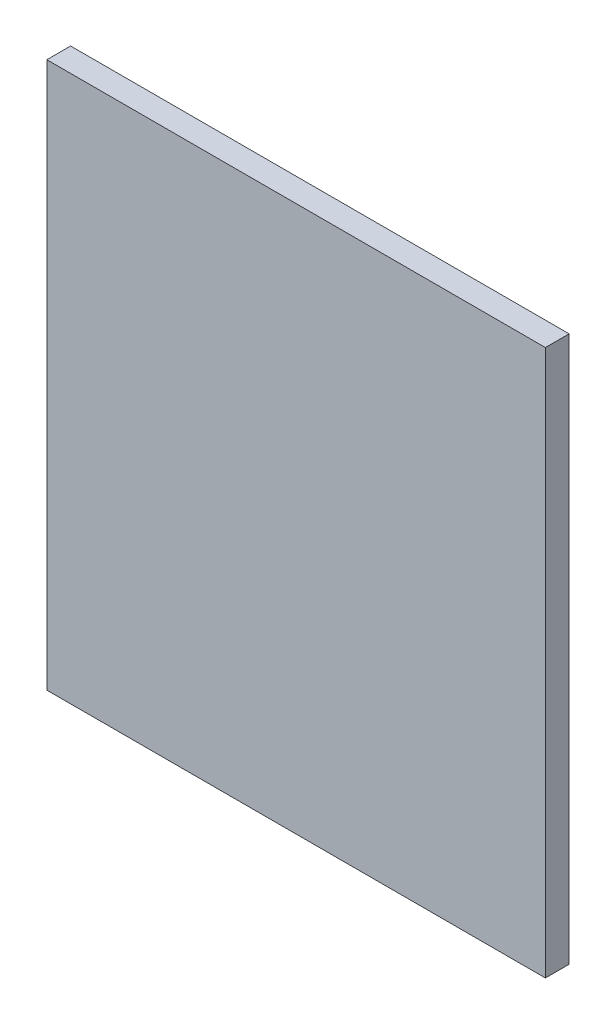
ISO-10303-21;
HEADER;
FILE_DESCRIPTION(('STEP AP214'),'2;1');
FILE_NAME('part.step','',(''),(''),'','','');
FILE_SCHEMA(('AUTOMOTIVE_DESIGN { 1 0 10303 214 1 1 1 1 }'));
ENDSEC;
DATA;
#1=APPLICATION_CONTEXT('core data for automotive mechanical design processes');
#2=APPLICATION_PROTOCOL_DEFINITION('international standard','automotive_design',2000,#1);
#3=PRODUCT_CONTEXT('',#1,'mechanical');
#4=PRODUCT('Part','Part','',(#3));
#5=PRODUCT_RELATED_PRODUCT_CATEGORY('part','',(#4));
#6=PRODUCT_DEFINITION_FORMATION('','',#4);
#7=PRODUCT_DEFINITION_CONTEXT('part definition',#1,'design');
#8=PRODUCT_DEFINITION('design','',#6,#7);
#9=PRODUCT_DEFINITION_SHAPE('','',#8);
#10=(LENGTH_UNIT() NAMED_UNIT(*) SI_UNIT(.MILLI.,.METRE.));
#11=(NAMED_UNIT(*) PLANE_ANGLE_UNIT() SI_UNIT($,.RADIAN.));
#12=(NAMED_UNIT(*) SI_UNIT($,.STERADIAN.) SOLID_ANGLE_UNIT());
#13=UNCERTAINTY_MEASURE_WITH_UNIT(LENGTH_MEASURE(1.E-05),#10,'distance_accuracy_value','');
#14=(GEOMETRIC_REPRESENTATION_CONTEXT(3) GLOBAL_UNCERTAINTY_ASSIGNED_CONTEXT((#13)) GLOBAL_UNIT_ASSIGNED_CONTEXT((#10,
#11,#12)) REPRESENTATION_CONTEXT('',''));
#15=CARTESIAN_POINT('',(0.,0.,0.));
#16=DIRECTION('',(0.,0.,1.));
#17=DIRECTION('',(1.,0.,0.));
#18=AXIS2_PLACEMENT_3D('',#15,#16,#17);
#19=CARTESIAN_POINT('',(133.35,146.05,6.35));
#20=DIRECTION('',(-1.,0.,0.));
#21=DIRECTION('',(0.,-1.,0.));
#22=AXIS2_PLACEMENT_3D('',#19,#20,#21);
#23=PLANE('',#22);
#24=DIRECTION('',(0.,1.,0.));
#25=VECTOR('',#24,1.);
#26=CARTESIAN_POINT('',(133.35,146.05,-6.35));
#27=LINE('',#26,#25);
#28=CARTESIAN_POINT('',(133.35,-146.05,-6.35));
#29=VERTEX_POINT('',#28);
#30=CARTESIAN_POINT('',(133.35,146.05,-6.35));
#31=VERTEX_POINT('',#30);
#32=EDGE_CURVE('E107',#29,#31,#27,.T.);
#33=ORIENTED_EDGE('',*,*,#32,.T.);
#34=DIRECTION('',(0.,0.,-1.));
#35=VECTOR('',#34,1.);
#36=CARTESIAN_POINT('',(133.35,146.05,6.35));
#37=LINE('',#36,#35);
#38=CARTESIAN_POINT('',(133.35,146.05,6.35));
#39=VERTEX_POINT('',#38);
#40=EDGE_CURVE('E11',#39,#31,#37,.T.);
#41=ORIENTED_EDGE('',*,*,#40,.F.);
#42=DIRECTION('',(0.,1.,0.));
#43=VECTOR('',#42,1.);
#44=CARTESIAN_POINT('',(133.35,146.05,6.35));
#45=LINE('',#44,#43);
#46=CARTESIAN_POINT('',(133.35,-146.05,6.35));
#47=VERTEX_POINT('',#46);
#48=EDGE_CURVE('E91',#47,#39,#45,.T.);
#49=ORIENTED_EDGE('',*,*,#48,.F.);
#50=DIRECTION('',(0.,0.,-1.));
#51=VECTOR('',#50,1.);
#52=CARTESIAN_POINT('',(133.35,-146.05,6.35));
#53=LINE('',#52,#51);
#54=EDGE_CURVE('E103',#47,#29,#53,.T.);
#55=ORIENTED_EDGE('',*,*,#54,.T.);
#56=EDGE_LOOP('',(#33,#41,#49,#55));
#57=FACE_BOUND('',#56,.T.);
#58=ADVANCED_FACE('F39',(#57),#23,.F.);
#59=CARTESIAN_POINT('',(-133.35,146.05,6.35));
#60=DIRECTION('',(0.,-1.,0.));
#61=DIRECTION('',(0.,0.,-1.));
#62=AXIS2_PLACEMENT_3D('',#59,#60,#61);
#63=PLANE('',#62);
#64=DIRECTION('',(-1.,0.,0.));
#65=VECTOR('',#64,1.);
#66=CARTESIAN_POINT('',(-133.35,146.05,-6.35));
#67=LINE('',#66,#65);
#68=CARTESIAN_POINT('',(-133.35,146.05,-6.35));
#69=VERTEX_POINT('',#68);
#70=EDGE_CURVE('E96',#31,#69,#67,.T.);
#71=ORIENTED_EDGE('',*,*,#70,.T.);
#72=DIRECTION('',(0.,0.,-1.));
#73=VECTOR('',#72,1.);
#74=CARTESIAN_POINT('',(-133.35,146.05,6.35));
#75=LINE('',#74,#73);
#76=CARTESIAN_POINT('',(-133.35,146.05,6.35));
#77=VERTEX_POINT('',#76);
#78=EDGE_CURVE('E48',#77,#69,#75,.T.);
#79=ORIENTED_EDGE('',*,*,#78,.F.);
#80=DIRECTION('',(-1.,0.,0.));
#81=VECTOR('',#80,1.);
#82=CARTESIAN_POINT('',(-133.35,146.05,6.35));
#83=LINE('',#82,#81);
#84=EDGE_CURVE('E86',#39,#77,#83,.T.);
#85=ORIENTED_EDGE('',*,*,#84,.F.);
#86=ORIENTED_EDGE('',*,*,#40,.T.);
#87=EDGE_LOOP('',(#71,#79,#85,#86));
#88=FACE_BOUND('',#87,.T.);
#89=ADVANCED_FACE('F95',(#88),#63,.F.);
#90=CARTESIAN_POINT('',(-133.35,146.05,6.35));
#91=DIRECTION('',(1.,0.,0.));
#92=DIRECTION('',(0.,1.,0.));
#93=AXIS2_PLACEMENT_3D('',#90,#91,#92);
#94=PLANE('',#93);
#95=DIRECTION('',(0.,-1.,0.));
#96=VECTOR('',#95,1.);
#97=CARTESIAN_POINT('',(-133.35,146.05,-6.35));
#98=LINE('',#97,#96);
#99=CARTESIAN_POINT('',(-133.35,-146.05,-6.35));
#100=VERTEX_POINT('',#99);
#101=EDGE_CURVE('E73',#69,#100,#98,.T.);
#102=ORIENTED_EDGE('',*,*,#101,.T.);
#103=DIRECTION('',(0.,0.,-1.));
#104=VECTOR('',#103,1.);
#105=CARTESIAN_POINT('',(-133.35,-146.05,6.35));
#106=LINE('',#105,#104);
#107=CARTESIAN_POINT('',(-133.35,-146.05,6.35));
#108=VERTEX_POINT('',#107);
#109=EDGE_CURVE('E98',#108,#100,#106,.T.);
#110=ORIENTED_EDGE('',*,*,#109,.F.);
#111=DIRECTION('',(0.,-1.,0.));
#112=VECTOR('',#111,1.);
#113=CARTESIAN_POINT('',(-133.35,146.05,6.35));
#114=LINE('',#113,#112);
#115=EDGE_CURVE('E89',#77,#108,#114,.T.);
#116=ORIENTED_EDGE('',*,*,#115,.F.);
#117=ORIENTED_EDGE('',*,*,#78,.T.);
#118=EDGE_LOOP('',(#102,#110,#116,#117));
#119=FACE_BOUND('',#118,.T.);
#120=ADVANCED_FACE('F99',(#119),#94,.F.);
#121=CARTESIAN_POINT('',(-133.35,-146.05,6.35));
#122=DIRECTION('',(0.,1.,0.));
#123=DIRECTION('',(0.,0.,1.));
#124=AXIS2_PLACEMENT_3D('',#121,#122,#123);
#125=PLANE('',#124);
#126=DIRECTION('',(1.,0.,0.));
#127=VECTOR('',#126,1.);
#128=CARTESIAN_POINT('',(-133.35,-146.05,-6.35));
#129=LINE('',#128,#127);
#130=EDGE_CURVE('E79',#100,#29,#129,.T.);
#131=ORIENTED_EDGE('',*,*,#130,.T.);
#132=ORIENTED_EDGE('',*,*,#54,.F.);
#133=DIRECTION('',(1.,0.,0.));
#134=VECTOR('',#133,1.);
#135=CARTESIAN_POINT('',(-133.35,-146.05,6.35));
#136=LINE('',#135,#134);
#137=EDGE_CURVE('E56',#108,#47,#136,.T.);
#138=ORIENTED_EDGE('',*,*,#137,.F.);
#139=ORIENTED_EDGE('',*,*,#109,.T.);
#140=EDGE_LOOP('',(#131,#132,#138,#139));
#141=FACE_BOUND('',#140,.T.);
#142=ADVANCED_FACE('F120',(#141),#125,.F.);
#143=CARTESIAN_POINT('',(0.,0.,6.35));
#144=DIRECTION('',(0.,0.,1.));
#145=DIRECTION('',(1.,0.,0.));
#146=AXIS2_PLACEMENT_3D('',#143,#144,#145);
#147=PLANE('',#146);
#148=ORIENTED_EDGE('',*,*,#48,.T.);
#149=ORIENTED_EDGE('',*,*,#84,.T.);
#150=ORIENTED_EDGE('',*,*,#115,.T.);
#151=ORIENTED_EDGE('',*,*,#137,.T.);
#152=EDGE_LOOP('',(#148,#149,#150,#151));
#153=FACE_BOUND('',#152,.T.);
#154=ADVANCED_FACE('F87',(#153),#147,.T.);
#155=CARTESIAN_POINT('',(0.,0.,-6.35));
#156=DIRECTION('',(0.,0.,1.));
#157=DIRECTION('',(1.,0.,0.));
#158=AXIS2_PLACEMENT_3D('',#155,#156,#157);
#159=PLANE('',#158);
#160=ORIENTED_EDGE('',*,*,#32,.F.);
#161=ORIENTED_EDGE('',*,*,#130,.F.);
#162=ORIENTED_EDGE('',*,*,#101,.F.);
#163=ORIENTED_EDGE('',*,*,#70,.F.);
#164=EDGE_LOOP('',(#160,#161,#162,#163));
#165=FACE_BOUND('',#164,.T.);
#166=ADVANCED_FACE('F123',(#165),#159,.F.);
#167=CLOSED_SHELL('',(#58,#89,#120,#142,#154,#166));
#168=MANIFOLD_SOLID_BREP('B2',#167);
#169=ADVANCED_BREP_SHAPE_REPRESENTATION('',(#18,#168),#14);
#170=SHAPE_DEFINITION_REPRESENTATION(#9,#169);
ENDSEC;
END-ISO-10303-21;
